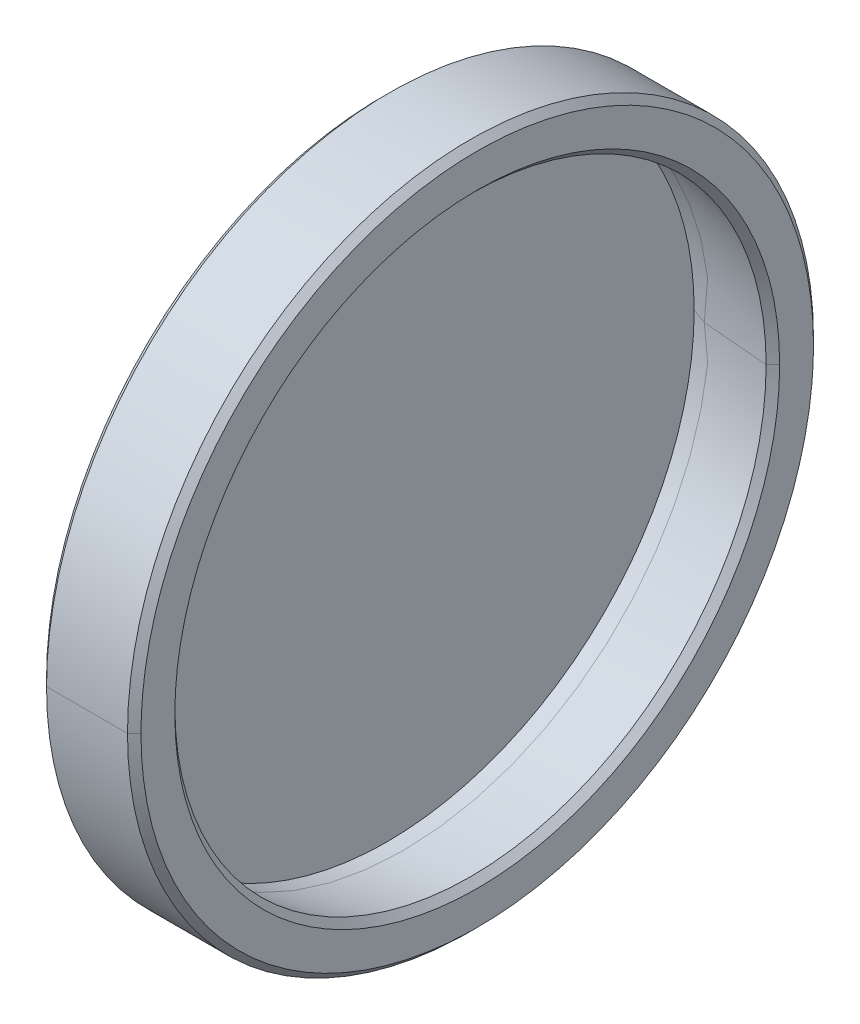
ISO-10303-21;
HEADER;
FILE_DESCRIPTION(('STEP AP214'),'2;1');
FILE_NAME('part.step','',(''),(''),'','','');
FILE_SCHEMA(('AUTOMOTIVE_DESIGN { 1 0 10303 214 1 1 1 1 }'));
ENDSEC;
DATA;
#1=APPLICATION_CONTEXT('core data for automotive mechanical design processes');
#2=APPLICATION_PROTOCOL_DEFINITION('international standard','automotive_design',2000,#1);
#3=PRODUCT_CONTEXT('',#1,'mechanical');
#4=PRODUCT('Part','Part','',(#3));
#5=PRODUCT_RELATED_PRODUCT_CATEGORY('part','',(#4));
#6=PRODUCT_DEFINITION_FORMATION('','',#4);
#7=PRODUCT_DEFINITION_CONTEXT('part definition',#1,'design');
#8=PRODUCT_DEFINITION('design','',#6,#7);
#9=PRODUCT_DEFINITION_SHAPE('','',#8);
#10=(LENGTH_UNIT() NAMED_UNIT(*) SI_UNIT(.MILLI.,.METRE.));
#11=(NAMED_UNIT(*) PLANE_ANGLE_UNIT() SI_UNIT($,.RADIAN.));
#12=(NAMED_UNIT(*) SI_UNIT($,.STERADIAN.) SOLID_ANGLE_UNIT());
#13=UNCERTAINTY_MEASURE_WITH_UNIT(LENGTH_MEASURE(1.E-05),#10,'distance_accuracy_value','');
#14=(GEOMETRIC_REPRESENTATION_CONTEXT(3) GLOBAL_UNCERTAINTY_ASSIGNED_CONTEXT((#13)) GLOBAL_UNIT_ASSIGNED_CONTEXT((#10,
#11,#12)) REPRESENTATION_CONTEXT('',''));
#15=CARTESIAN_POINT('',(0.,0.,0.));
#16=DIRECTION('',(0.,0.,1.));
#17=DIRECTION('',(1.,0.,0.));
#18=AXIS2_PLACEMENT_3D('',#15,#16,#17);
#19=CARTESIAN_POINT('',(0.9,0.,0.));
#20=DIRECTION('',(-1.,0.,0.));
#21=DIRECTION('',(0.,0.,1.));
#22=AXIS2_PLACEMENT_3D('',#19,#20,#21);
#23=CYLINDRICAL_SURFACE('',#22,13.645);
#24=CARTESIAN_POINT('',(0.9,0.,0.));
#25=DIRECTION('',(1.,0.,0.));
#26=DIRECTION('',(0.,0.,-1.));
#27=AXIS2_PLACEMENT_3D('',#24,#25,#26);
#28=CIRCLE('',#27,13.645);
#29=CARTESIAN_POINT('',(0.9,0.,-13.395));
#30=VERTEX_POINT('',#29);
#31=CARTESIAN_POINT('',(0.9,0.,13.395));
#32=VERTEX_POINT('',#31);
#33=EDGE_CURVE('E34',#30,#32,#28,.T.);
#34=ORIENTED_EDGE('',*,*,#33,.T.);
#35=CARTESIAN_POINT('',(0.2,0.,13.645));
#36=DIRECTION('',(1.,0.,0.));
#37=VECTOR('',#36,1.);
#38=LINE('',#35,#37);
#39=CARTESIAN_POINT('',(0.2,0.,13.645));
#40=VERTEX_POINT('',#39);
#41=EDGE_CURVE('E91',#40,#32,#38,.T.);
#42=ORIENTED_EDGE('',*,*,#41,.F.);
#43=CARTESIAN_POINT('',(0.2,0.,-13.645));
#44=CARTESIAN_POINT('',(0.2,1.34363747488083,-13.645));
#45=CARTESIAN_POINT('',(0.2,2.66200744391007,-13.3828151511021));
#46=CARTESIAN_POINT('',(0.2,3.97957081874608,-13.1207907099665));
#47=CARTESIAN_POINT('',(0.2,5.22171543462165,-12.6063362211165));
#48=CARTESIAN_POINT('',(0.2,6.46284376605702,-12.0923026430731));
#49=CARTESIAN_POINT('',(0.2,7.58075582955247,-11.3454028598682));
#50=CARTESIAN_POINT('',(0.2,8.6977532518318,-10.5991141670597));
#51=CARTESIAN_POINT('',(0.2,9.64847202929044,-9.64847202929044));
#52=CARTESIAN_POINT('',(0.2,10.5984129579128,-8.69860767765319));
#53=CARTESIAN_POINT('',(0.2,11.3454028598682,-7.58075582955247));
#54=CARTESIAN_POINT('',(0.2,12.0917815976864,-6.46381857341421));
#55=CARTESIAN_POINT('',(0.2,12.6063362211165,-5.22171543462165));
#56=CARTESIAN_POINT('',(0.2,13.1204698518036,-3.98062854635668));
#57=CARTESIAN_POINT('',(0.2,13.3828151511021,-2.66200744391007));
#58=CARTESIAN_POINT('',(0.2,13.6449458075597,-1.34446519662178));
#59=CARTESIAN_POINT('',(0.2,13.645,0.));
#60=CARTESIAN_POINT('',(0.2,13.6450541481017,1.34336519663393));
#61=CARTESIAN_POINT('',(0.2,13.3828151511021,2.66200744391007));
#62=CARTESIAN_POINT('',(0.2,13.1207907099659,3.97957081874861));
#63=CARTESIAN_POINT('',(0.2,12.6063362211165,5.22171543462165));
#64=CARTESIAN_POINT('',(0.2,12.092302643072,6.46284376605874));
#65=CARTESIAN_POINT('',(0.2,11.3454028598682,7.58075582955247));
#66=CARTESIAN_POINT('',(0.2,10.5991141670512,8.69775325184458));
#67=CARTESIAN_POINT('',(0.2,9.64847202929044,9.64847202929044));
#68=CARTESIAN_POINT('',(0.2,8.69860767764255,10.5984129579192));
#69=CARTESIAN_POINT('',(0.2,7.58075582955247,11.3454028598682));
#70=CARTESIAN_POINT('',(0.2,6.463818573417,12.0917815976852));
#71=CARTESIAN_POINT('',(0.2,5.22171543462165,12.6063362211165));
#72=CARTESIAN_POINT('',(0.2,3.98062854635668,13.1204698518036));
#73=CARTESIAN_POINT('',(0.2,2.66200744391007,13.3828151511021));
#74=CARTESIAN_POINT('',(0.2,1.34419281020761,13.645));
#75=CARTESIAN_POINT('',(0.2,0.,13.645));
#76=B_SPLINE_CURVE_WITH_KNOTS('',2,(#43,#44,#45,#46,#47,#48,#49,#50,#51,#52,#53,#54,#55,#56,#57,
#58,#59,#60,#61,#62,#63,#64,#65,#66,#67,#68,#69,#70,#71,#72,#73,#74,#75),.UNSPECIFIED.,.F.,.F.,
(3,2,2,2,2,2,2,2,2,2,2,2,2,2,2,2,3),(0.,0.0625,0.125,0.1875,0.25,0.3125,0.375,0.4375,0.5,0.5625,
0.625,0.6875,0.75,0.8125,0.875,0.9375,1.),.UNSPECIFIED.);
#77=CARTESIAN_POINT('',(0.2,0.,-13.645));
#78=VERTEX_POINT('',#77);
#79=EDGE_CURVE('E101',#78,#40,#76,.T.);
#80=ORIENTED_EDGE('',*,*,#79,.F.);
#81=CARTESIAN_POINT('',(0.9,0.,-13.645));
#82=DIRECTION('',(-1.,0.,0.));
#83=VECTOR('',#82,1.);
#84=LINE('',#81,#83);
#85=EDGE_CURVE('E88',#30,#78,#84,.T.);
#86=ORIENTED_EDGE('',*,*,#85,.F.);
#87=EDGE_LOOP('',(#34,#42,#80,#86));
#88=FACE_BOUND('',#87,.T.);
#89=ADVANCED_FACE('F15',(#88),#23,.F.);
#90=CARTESIAN_POINT('',(0.2,0.,0.));
#91=DIRECTION('',(1.,0.,0.));
#92=DIRECTION('',(0.,1.,0.));
#93=AXIS2_PLACEMENT_3D('',#90,#91,#92);
#94=PLANE('',#93);
#95=CARTESIAN_POINT('',(0.2,0.,13.645));
#96=CARTESIAN_POINT('',(0.2,-1.34363747488136,13.645));
#97=CARTESIAN_POINT('',(0.2,-2.66200744391007,13.3828151511021));
#98=CARTESIAN_POINT('',(0.2,-3.97957081873673,13.1207907099683));
#99=CARTESIAN_POINT('',(0.2,-5.22171543462165,12.6063362211165));
#100=CARTESIAN_POINT('',(0.2,-6.46284376604588,12.0923026430799));
#101=CARTESIAN_POINT('',(0.2,-7.58075582955247,11.3454028598682));
#102=CARTESIAN_POINT('',(0.2,-8.69775325183606,10.5991141670576));
#103=CARTESIAN_POINT('',(0.2,-9.64847202929044,9.64847202929044));
#104=CARTESIAN_POINT('',(0.2,-10.5984129579213,8.69860767764255));
#105=CARTESIAN_POINT('',(0.2,-11.3454028598682,7.58075582955247));
#106=CARTESIAN_POINT('',(0.2,-12.0917815976898,6.46381857340692));
#107=CARTESIAN_POINT('',(0.2,-12.6063362211165,5.22171543462166));
#108=CARTESIAN_POINT('',(0.2,-13.1204698518081,3.9806285463448));
#109=CARTESIAN_POINT('',(0.2,-13.3828151511021,2.66200744391007));
#110=CARTESIAN_POINT('',(0.2,-13.6449458075597,1.34446519661112));
#111=CARTESIAN_POINT('',(0.2,-13.645,0.));
#112=CARTESIAN_POINT('',(0.2,-13.6450541481017,-1.3433651966334));
#113=CARTESIAN_POINT('',(0.2,-13.3828151511021,-2.66200744391007));
#114=CARTESIAN_POINT('',(0.2,-13.1207907099661,-3.97957081874812));
#115=CARTESIAN_POINT('',(0.2,-12.6063362211165,-5.22171543462165));
#116=CARTESIAN_POINT('',(0.2,-12.0923026430708,-6.46284376606153));
#117=CARTESIAN_POINT('',(0.2,-11.3454028598682,-7.58075582955247));
#118=CARTESIAN_POINT('',(0.2,-10.5991141670533,-8.69775325184033));
#119=CARTESIAN_POINT('',(0.2,-9.64847202929044,-9.64847202929044));
#120=CARTESIAN_POINT('',(0.2,-8.69860767764467,-10.5984129579192));
#121=CARTESIAN_POINT('',(0.2,-7.58075582955247,-11.3454028598682));
#122=CARTESIAN_POINT('',(0.2,-6.46381857341141,-12.0917815976875));
#123=CARTESIAN_POINT('',(0.2,-5.22171543462166,-12.6063362211165));
#124=CARTESIAN_POINT('',(0.2,-3.98062854634684,-13.1204698518077));
#125=CARTESIAN_POINT('',(0.2,-2.66200744391007,-13.3828151511021));
#126=CARTESIAN_POINT('',(0.2,-1.34419281019695,-13.645));
#127=CARTESIAN_POINT('',(0.2,0.,-13.645));
#128=B_SPLINE_CURVE_WITH_KNOTS('',2,(#95,#96,#97,#98,#99,#100,#101,#102,#103,#104,#105,#106,
#107,#108,#109,#110,#111,#112,#113,#114,#115,#116,#117,#118,#119,#120,#121,#122,#123,#124,#125,
#126,#127),.UNSPECIFIED.,.F.,.F.,(3,2,2,2,2,2,2,2,2,2,2,2,2,2,2,2,3),(0.,0.0625,0.125,0.1875,
0.25,0.3125,0.375,0.4375,0.5,0.5625,0.625,0.6875,0.75,0.8125,0.875,0.9375,1.),.UNSPECIFIED.);
#129=EDGE_CURVE('E350',#40,#78,#128,.T.);
#130=ORIENTED_EDGE('',*,*,#129,.T.);
#131=ORIENTED_EDGE('',*,*,#79,.T.);
#132=EDGE_LOOP('',(#130,#131));
#133=FACE_BOUND('',#132,.T.);
#134=ADVANCED_FACE('F366',(#133),#94,.T.);
#135=CARTESIAN_POINT('',(0.9,0.,0.));
#136=DIRECTION('',(-1.,0.,0.));
#137=DIRECTION('',(0.,0.,1.));
#138=AXIS2_PLACEMENT_3D('',#135,#136,#137);
#139=CYLINDRICAL_SURFACE('',#138,13.645);
#140=ORIENTED_EDGE('',*,*,#85,.T.);
#141=ORIENTED_EDGE('',*,*,#129,.F.);
#142=ORIENTED_EDGE('',*,*,#41,.T.);
#143=CARTESIAN_POINT('',(0.9,0.,0.));
#144=DIRECTION('',(1.,0.,0.));
#145=DIRECTION('',(0.,0.,1.));
#146=AXIS2_PLACEMENT_3D('',#143,#144,#145);
#147=CIRCLE('',#146,13.645);
#148=EDGE_CURVE('E9',#32,#30,#147,.T.);
#149=ORIENTED_EDGE('',*,*,#148,.T.);
#150=EDGE_LOOP('',(#140,#141,#142,#149));
#151=FACE_BOUND('',#150,.T.);
#152=ADVANCED_FACE('F86',(#151),#139,.F.);
#153=CARTESIAN_POINT('',(0.,0.,0.));
#154=DIRECTION('',(1.,0.,0.));
#155=DIRECTION('',(0.,1.,0.));
#156=AXIS2_PLACEMENT_3D('',#153,#154,#155);
#157=PLANE('',#156);
#158=CARTESIAN_POINT('',(0.,0.,0.));
#159=DIRECTION('',(1.,0.,0.));
#160=DIRECTION('',(0.,0.,-1.));
#161=AXIS2_PLACEMENT_3D('',#158,#159,#160);
#162=CIRCLE('',#161,14.95);
#163=CARTESIAN_POINT('',(0.,0.,-14.95));
#164=VERTEX_POINT('',#163);
#165=CARTESIAN_POINT('',(0.,0.,14.95));
#166=VERTEX_POINT('',#165);
#167=EDGE_CURVE('E338',#164,#166,#162,.T.);
#168=ORIENTED_EDGE('',*,*,#167,.F.);
#169=CARTESIAN_POINT('',(0.,0.,0.));
#170=DIRECTION('',(1.,0.,0.));
#171=DIRECTION('',(0.,0.,1.));
#172=AXIS2_PLACEMENT_3D('',#169,#170,#171);
#173=CIRCLE('',#172,14.95);
#174=EDGE_CURVE('E344',#166,#164,#173,.T.);
#175=ORIENTED_EDGE('',*,*,#174,.F.);
#176=EDGE_LOOP('',(#168,#175));
#177=FACE_BOUND('',#176,.T.);
#178=ADVANCED_FACE('F385',(#177),#157,.F.);
#179=CARTESIAN_POINT('',(0.3,0.,0.));
#180=DIRECTION('',(1.,0.,0.));
#181=DIRECTION('',(0.,0.,-1.));
#182=AXIS2_PLACEMENT_3D('',#179,#180,#181);
#183=CONICAL_SURFACE('',#182,15.25,0.785398163397446);
#184=CARTESIAN_POINT('',(0.3,0.,-15.25));
#185=DIRECTION('',(-0.70710678118655,0.,0.707106781186545));
#186=VECTOR('',#185,1.);
#187=LINE('',#184,#186);
#188=CARTESIAN_POINT('',(0.3,0.,-15.25));
#189=VERTEX_POINT('',#188);
#190=EDGE_CURVE('E323',#189,#164,#187,.T.);
#191=ORIENTED_EDGE('',*,*,#190,.F.);
#192=CARTESIAN_POINT('',(0.3,0.,0.));
#193=DIRECTION('',(1.,0.,0.));
#194=DIRECTION('',(0.,0.,1.));
#195=AXIS2_PLACEMENT_3D('',#192,#193,#194);
#196=CIRCLE('',#195,15.25);
#197=CARTESIAN_POINT('',(0.3,0.,15.25));
#198=VERTEX_POINT('',#197);
#199=EDGE_CURVE('E316',#198,#189,#196,.T.);
#200=ORIENTED_EDGE('',*,*,#199,.F.);
#201=CARTESIAN_POINT('',(0.,0.,14.95));
#202=DIRECTION('',(0.70710678118655,0.,0.707106781186545));
#203=VECTOR('',#202,1.);
#204=LINE('',#201,#203);
#205=EDGE_CURVE('E330',#166,#198,#204,.T.);
#206=ORIENTED_EDGE('',*,*,#205,.F.);
#207=ORIENTED_EDGE('',*,*,#174,.T.);
#208=EDGE_LOOP('',(#191,#200,#206,#207));
#209=FACE_BOUND('',#208,.T.);
#210=ADVANCED_FACE('F635',(#209),#183,.T.);
#211=CARTESIAN_POINT('',(0.3,0.,0.));
#212=DIRECTION('',(1.,0.,0.));
#213=DIRECTION('',(0.,0.,-1.));
#214=AXIS2_PLACEMENT_3D('',#211,#212,#213);
#215=CONICAL_SURFACE('',#214,15.25,0.785398163397446);
#216=CARTESIAN_POINT('',(0.3,0.,0.));
#217=DIRECTION('',(1.,0.,0.));
#218=DIRECTION('',(0.,0.,-1.));
#219=AXIS2_PLACEMENT_3D('',#216,#217,#218);
#220=CIRCLE('',#219,15.25);
#221=EDGE_CURVE('E299',#189,#198,#220,.T.);
#222=ORIENTED_EDGE('',*,*,#221,.F.);
#223=ORIENTED_EDGE('',*,*,#190,.T.);
#224=ORIENTED_EDGE('',*,*,#167,.T.);
#225=ORIENTED_EDGE('',*,*,#205,.T.);
#226=EDGE_LOOP('',(#222,#223,#224,#225));
#227=FACE_BOUND('',#226,.T.);
#228=ADVANCED_FACE('F619',(#227),#215,.T.);
#229=CARTESIAN_POINT('',(4.2,0.,0.));
#230=DIRECTION('',(-1.,0.,0.));
#231=DIRECTION('',(0.,0.,1.));
#232=AXIS2_PLACEMENT_3D('',#229,#230,#231);
#233=CYLINDRICAL_SURFACE('',#232,15.25);
#234=CARTESIAN_POINT('',(0.3,0.,15.25));
#235=DIRECTION('',(1.,0.,0.));
#236=VECTOR('',#235,1.);
#237=LINE('',#234,#236);
#238=CARTESIAN_POINT('',(3.9,0.,15.25));
#239=VERTEX_POINT('',#238);
#240=EDGE_CURVE('E292',#198,#239,#237,.T.);
#241=ORIENTED_EDGE('',*,*,#240,.F.);
#242=ORIENTED_EDGE('',*,*,#199,.T.);
#243=CARTESIAN_POINT('',(3.89999999999999,0.,-15.25));
#244=DIRECTION('',(-1.,0.,0.));
#245=VECTOR('',#244,1.);
#246=LINE('',#243,#245);
#247=CARTESIAN_POINT('',(3.9,0.,-15.25));
#248=VERTEX_POINT('',#247);
#249=EDGE_CURVE('E308',#248,#189,#246,.T.);
#250=ORIENTED_EDGE('',*,*,#249,.F.);
#251=CARTESIAN_POINT('',(3.89999999999999,0.,0.));
#252=DIRECTION('',(1.,0.,0.));
#253=DIRECTION('',(0.,0.,1.));
#254=AXIS2_PLACEMENT_3D('',#251,#252,#253);
#255=CIRCLE('',#254,15.25);
#256=EDGE_CURVE('E285',#239,#248,#255,.T.);
#257=ORIENTED_EDGE('',*,*,#256,.F.);
#258=EDGE_LOOP('',(#241,#242,#250,#257));
#259=FACE_BOUND('',#258,.T.);
#260=ADVANCED_FACE('F595',(#259),#233,.T.);
#261=CARTESIAN_POINT('',(4.2,0.,0.));
#262=DIRECTION('',(-1.,0.,0.));
#263=DIRECTION('',(0.,0.,1.));
#264=AXIS2_PLACEMENT_3D('',#261,#262,#263);
#265=CYLINDRICAL_SURFACE('',#264,15.25);
#266=ORIENTED_EDGE('',*,*,#221,.T.);
#267=ORIENTED_EDGE('',*,*,#240,.T.);
#268=CARTESIAN_POINT('',(3.89999999999999,0.,0.));
#269=DIRECTION('',(1.,0.,0.));
#270=DIRECTION('',(0.,0.,-1.));
#271=AXIS2_PLACEMENT_3D('',#268,#269,#270);
#272=CIRCLE('',#271,15.25);
#273=EDGE_CURVE('E268',#248,#239,#272,.T.);
#274=ORIENTED_EDGE('',*,*,#273,.F.);
#275=ORIENTED_EDGE('',*,*,#249,.T.);
#276=EDGE_LOOP('',(#266,#267,#274,#275));
#277=FACE_BOUND('',#276,.T.);
#278=ADVANCED_FACE('F579',(#277),#265,.T.);
#279=CARTESIAN_POINT('',(4.2,0.,0.));
#280=DIRECTION('',(-1.,0.,0.));
#281=DIRECTION('',(0.,0.,1.));
#282=AXIS2_PLACEMENT_3D('',#279,#280,#281);
#283=CONICAL_SURFACE('',#282,14.95,0.785398163397446);
#284=CARTESIAN_POINT('',(3.89999999999999,0.,15.25));
#285=DIRECTION('',(0.707106781186549,0.,-0.707106781186545));
#286=VECTOR('',#285,1.);
#287=LINE('',#284,#286);
#288=CARTESIAN_POINT('',(4.2,0.,14.95));
#289=VERTEX_POINT('',#288);
#290=EDGE_CURVE('E262',#239,#289,#287,.T.);
#291=ORIENTED_EDGE('',*,*,#290,.F.);
#292=ORIENTED_EDGE('',*,*,#256,.T.);
#293=CARTESIAN_POINT('',(4.2,0.,-14.95));
#294=DIRECTION('',(-0.707106781186549,0.,-0.707106781186545));
#295=VECTOR('',#294,1.);
#296=LINE('',#293,#295);
#297=CARTESIAN_POINT('',(4.2,0.,-14.95));
#298=VERTEX_POINT('',#297);
#299=EDGE_CURVE('E277',#298,#248,#296,.T.);
#300=ORIENTED_EDGE('',*,*,#299,.F.);
#301=CARTESIAN_POINT('',(4.2,0.,14.95));
#302=CARTESIAN_POINT('',(4.2,-1.47216876116469,14.95));
#303=CARTESIAN_POINT('',(4.2,-2.91660031414112,14.6627399420283));
#304=CARTESIAN_POINT('',(4.2,-4.36022527837732,14.3756402936847));
#305=CARTESIAN_POINT('',(4.2,-5.72111731385809,13.8119990110437));
#306=CARTESIAN_POINT('',(4.2,-7.08099306636477,13.2487786427913));
#307=CARTESIAN_POINT('',(4.2,-8.30577498364304,12.430470703923));
#308=CARTESIAN_POINT('',(4.2,-9.52964226186681,11.6127738586617));
#309=CARTESIAN_POINT('',(4.2,-10.5712463787389,10.5712463787389));
#310=CARTESIAN_POINT('',(4.2,-11.6120726495368,9.53049668765955));
#311=CARTESIAN_POINT('',(4.2,-12.430470703923,8.30577498364305));
#312=CARTESIAN_POINT('',(4.2,-13.2482575974103,7.08196787370897));
#313=CARTESIAN_POINT('',(4.2,-13.8119990110437,5.7211173138581));
#314=CARTESIAN_POINT('',(4.2,-14.375319435523,4.36128300598411));
#315=CARTESIAN_POINT('',(4.2,-14.6627399420283,2.91660031414112));
#316=CARTESIAN_POINT('',(4.2,-14.9499458094936,1.4729964781868));
#317=CARTESIAN_POINT('',(4.2,-14.95,0.));
#318=CARTESIAN_POINT('',(4.2,-14.9500541500381,-1.47189647820035));
#319=CARTESIAN_POINT('',(4.2,-14.6627399420283,-2.91660031414112));
#320=CARTESIAN_POINT('',(4.2,-14.37564029368,-4.36022527838862));
#321=CARTESIAN_POINT('',(4.2,-13.8119990110437,-5.72111731385809));
#322=CARTESIAN_POINT('',(4.2,-13.2487786427888,-7.08099306637088));
#323=CARTESIAN_POINT('',(4.2,-12.430470703923,-8.30577498364304));
#324=CARTESIAN_POINT('',(4.2,-11.6127738586523,-9.52964226187848));
#325=CARTESIAN_POINT('',(4.2,-10.5712463787389,-10.5712463787389));
#326=CARTESIAN_POINT('',(4.2,-9.53049668764788,-11.6120726495461));
#327=CARTESIAN_POINT('',(4.2,-8.30577498364305,-12.430470703923));
#328=CARTESIAN_POINT('',(4.2,-7.08196787370286,-13.2482575974129));
#329=CARTESIAN_POINT('',(4.2,-5.7211173138581,-13.8119990110437));
#330=CARTESIAN_POINT('',(4.2,-4.36128300598411,-14.375319435523));
#331=CARTESIAN_POINT('',(4.2,-2.91660031414112,-14.6627399420283));
#332=CARTESIAN_POINT('',(4.2,-1.47272409648544,-14.95));
#333=CARTESIAN_POINT('',(4.2,0.,-14.95));
#334=B_SPLINE_CURVE_WITH_KNOTS('',2,(#301,#302,#303,#304,#305,#306,#307,#308,#309,#310,#311,
#312,#313,#314,#315,#316,#317,#318,#319,#320,#321,#322,#323,#324,#325,#326,#327,#328,#329,#330,
#331,#332,#333),.UNSPECIFIED.,.F.,.F.,(3,2,2,2,2,2,2,2,2,2,2,2,2,2,2,2,3),(0.,0.0625,0.125,
0.1875,0.25,0.3125,0.375,0.4375,0.5,0.5625,0.625,0.6875,0.75,0.8125,0.875,0.9375,1.),.UNSPECIFIED.);
#335=EDGE_CURVE('E252',#289,#298,#334,.T.);
#336=ORIENTED_EDGE('',*,*,#335,.F.);
#337=EDGE_LOOP('',(#291,#292,#300,#336));
#338=FACE_BOUND('',#337,.T.);
#339=ADVANCED_FACE('F555',(#338),#283,.T.);
#340=CARTESIAN_POINT('',(4.2,0.,0.));
#341=DIRECTION('',(-1.,0.,0.));
#342=DIRECTION('',(0.,0.,1.));
#343=AXIS2_PLACEMENT_3D('',#340,#341,#342);
#344=CONICAL_SURFACE('',#343,14.95,0.785398163397446);
#345=ORIENTED_EDGE('',*,*,#273,.T.);
#346=ORIENTED_EDGE('',*,*,#290,.T.);
#347=CARTESIAN_POINT('',(4.2,0.,-14.95));
#348=CARTESIAN_POINT('',(4.2,1.47216876116623,-14.95));
#349=CARTESIAN_POINT('',(4.2,2.91660031414112,-14.6627399420283));
#350=CARTESIAN_POINT('',(4.2,4.3602252783788,-14.3756402936841));
#351=CARTESIAN_POINT('',(4.2,5.72111731385809,-13.8119990110437));
#352=CARTESIAN_POINT('',(4.2,7.08099306636506,-13.2487786427912));
#353=CARTESIAN_POINT('',(4.2,8.30577498364305,-12.430470703923));
#354=CARTESIAN_POINT('',(4.2,9.52964226185299,-11.6127738586708));
#355=CARTESIAN_POINT('',(4.2,10.5712463787389,-10.5712463787389));
#356=CARTESIAN_POINT('',(4.2,11.6120726495272,-9.53049668767375));
#357=CARTESIAN_POINT('',(4.2,12.430470703923,-8.30577498364305));
#358=CARTESIAN_POINT('',(4.2,13.248257597411,-7.08196787370805));
#359=CARTESIAN_POINT('',(4.2,13.8119990110437,-5.72111731385809));
#360=CARTESIAN_POINT('',(4.2,14.3753194355184,-4.36128300599435));
#361=CARTESIAN_POINT('',(4.2,14.6627399420283,-2.91660031414112));
#362=CARTESIAN_POINT('',(4.2,14.9499458094936,-1.4729964781994));
#363=CARTESIAN_POINT('',(4.2,14.95,0.));
#364=CARTESIAN_POINT('',(4.2,14.9500541500381,1.47189647818956));
#365=CARTESIAN_POINT('',(4.2,14.6627399420283,2.91660031414112));
#366=CARTESIAN_POINT('',(4.2,14.375640293684,4.3602252783795));
#367=CARTESIAN_POINT('',(4.2,13.8119990110437,5.72111731385809));
#368=CARTESIAN_POINT('',(4.2,13.2487786427845,7.08099306638073));
#369=CARTESIAN_POINT('',(4.2,12.430470703923,8.30577498364304));
#370=CARTESIAN_POINT('',(4.2,11.61277385865,9.52964226187848));
#371=CARTESIAN_POINT('',(4.2,10.5712463787389,10.5712463787389));
#372=CARTESIAN_POINT('',(4.2,9.53049668766654,11.6120726495298));
#373=CARTESIAN_POINT('',(4.2,8.30577498364305,12.430470703923));
#374=CARTESIAN_POINT('',(4.2,7.08196787371812,13.2482575974066));
#375=CARTESIAN_POINT('',(4.2,5.72111731385809,13.8119990110437));
#376=CARTESIAN_POINT('',(4.2,4.36128300599489,14.3753194355185));
#377=CARTESIAN_POINT('',(4.2,2.91660031414112,14.6627399420283));
#378=CARTESIAN_POINT('',(4.2,1.47272409649711,14.95));
#379=CARTESIAN_POINT('',(4.2,0.,14.95));
#380=B_SPLINE_CURVE_WITH_KNOTS('',2,(#347,#348,#349,#350,#351,#352,#353,#354,#355,#356,#357,
#358,#359,#360,#361,#362,#363,#364,#365,#366,#367,#368,#369,#370,#371,#372,#373,#374,#375,#376,
#377,#378,#379),.UNSPECIFIED.,.F.,.F.,(3,2,2,2,2,2,2,2,2,2,2,2,2,2,2,2,3),(0.,0.0625,0.125,
0.1875,0.25,0.3125,0.375,0.4375,0.5,0.5625,0.625,0.6875,0.75,0.8125,0.875,0.9375,1.),.UNSPECIFIED.);
#381=EDGE_CURVE('E245',#298,#289,#380,.T.);
#382=ORIENTED_EDGE('',*,*,#381,.F.);
#383=ORIENTED_EDGE('',*,*,#299,.T.);
#384=EDGE_LOOP('',(#345,#346,#382,#383));
#385=FACE_BOUND('',#384,.T.);
#386=ADVANCED_FACE('F536',(#385),#344,.T.);
#387=CARTESIAN_POINT('',(4.2,0.,0.));
#388=DIRECTION('',(1.,0.,0.));
#389=DIRECTION('',(0.,1.,0.));
#390=AXIS2_PLACEMENT_3D('',#387,#388,#389);
#391=PLANE('',#390);
#392=CARTESIAN_POINT('',(4.2,0.,-13.445));
#393=CARTESIAN_POINT('',(4.2,-1.32393919337343,-13.445));
#394=CARTESIAN_POINT('',(4.2,-2.62298937950684,-13.1866580950214));
#395=CARTESIAN_POINT('',(4.2,-3.92123297051703,-12.9284765974874));
#396=CARTESIAN_POINT('',(4.2,-5.14517874814863,-12.4215603146142));
#397=CARTESIAN_POINT('',(4.2,-6.36810824110222,-11.9150649419323));
#398=CARTESIAN_POINT('',(4.2,-7.46964178294855,-11.1791089374077));
#399=CARTESIAN_POINT('',(4.2,-8.57026068323837,-10.4437640227137));
#400=CARTESIAN_POINT('',(4.2,-9.50705067305313,-9.50705067305313));
#401=CARTESIAN_POINT('',(4.2,-10.4430628135822,-8.57111510904126));
#402=CARTESIAN_POINT('',(4.2,-11.1791089374077,-7.46964178294855));
#403=CARTESIAN_POINT('',(4.2,-11.9145438965481,-6.36908304845106));
#404=CARTESIAN_POINT('',(4.2,-12.4215603146142,-5.14517874814863));
#405=CARTESIAN_POINT('',(4.2,-12.9281557393253,-3.92229069812793));
#406=CARTESIAN_POINT('',(4.2,-13.1866580950214,-2.62298937950684));
#407=CARTESIAN_POINT('',(4.2,-13.444945807229,-1.32476691591946));
#408=CARTESIAN_POINT('',(4.2,-13.445,0.));
#409=CARTESIAN_POINT('',(4.2,-13.4450541477728,1.32366691592174));
#410=CARTESIAN_POINT('',(4.2,-13.1866580950214,2.62298937950684));
#411=CARTESIAN_POINT('',(4.2,-12.9284765974904,3.92123297050638));
#412=CARTESIAN_POINT('',(4.2,-12.4215603146142,5.14517874814863));
#413=CARTESIAN_POINT('',(4.2,-11.9150649419393,6.36810824108869));
#414=CARTESIAN_POINT('',(4.2,-11.1791089374077,7.46964178294854));
#415=CARTESIAN_POINT('',(4.2,-10.4437640227157,8.57026068323843));
#416=CARTESIAN_POINT('',(4.2,-9.50705067305313,9.50705067305312));
#417=CARTESIAN_POINT('',(4.2,-8.57111510903504,10.4430628135863));
#418=CARTESIAN_POINT('',(4.2,-7.46964178294855,11.1791089374077));
#419=CARTESIAN_POINT('',(4.2,-6.3690830484498,11.914543896549));
#420=CARTESIAN_POINT('',(4.2,-5.14517874814863,12.4215603146142));
#421=CARTESIAN_POINT('',(4.2,-3.92229069813293,12.9281557393229));
#422=CARTESIAN_POINT('',(4.2,-2.62298937950685,13.1866580950214));
#423=CARTESIAN_POINT('',(4.2,-1.32449452870378,13.445));
#424=CARTESIAN_POINT('',(4.2,0.,13.445));
#425=B_SPLINE_CURVE_WITH_KNOTS('',2,(#392,#393,#394,#395,#396,#397,#398,#399,#400,#401,#402,
#403,#404,#405,#406,#407,#408,#409,#410,#411,#412,#413,#414,#415,#416,#417,#418,#419,#420,#421,
#422,#423,#424),.UNSPECIFIED.,.F.,.F.,(3,2,2,2,2,2,2,2,2,2,2,2,2,2,2,2,3),(0.,0.0625,0.125,
0.1875,0.25,0.3125,0.375,0.4375,0.5,0.5625,0.625,0.6875,0.75,0.8125,0.875,0.9375,1.),.UNSPECIFIED.);
#426=CARTESIAN_POINT('',(4.2,0.,-13.445));
#427=VERTEX_POINT('',#426);
#428=CARTESIAN_POINT('',(4.2,0.,13.445));
#429=VERTEX_POINT('',#428);
#430=EDGE_CURVE('E231',#427,#429,#425,.T.);
#431=ORIENTED_EDGE('',*,*,#430,.T.);
#432=CARTESIAN_POINT('',(4.2,0.,13.445));
#433=CARTESIAN_POINT('',(4.2,1.32393919336594,13.445));
#434=CARTESIAN_POINT('',(4.2,2.62298937950684,13.1866580950214));
#435=CARTESIAN_POINT('',(4.2,3.92123297049444,12.9284765974934));
#436=CARTESIAN_POINT('',(4.2,5.14517874814863,12.4215603146142));
#437=CARTESIAN_POINT('',(4.2,6.36810824106708,11.9150649419502));
#438=CARTESIAN_POINT('',(4.2,7.46964178294854,11.1791089374077));
#439=CARTESIAN_POINT('',(4.2,8.57026068322164,10.4437640227304));
#440=CARTESIAN_POINT('',(4.2,9.50705067305312,9.50705067305313));
#441=CARTESIAN_POINT('',(4.2,10.4430628135884,8.57111510903504));
#442=CARTESIAN_POINT('',(4.2,11.1791089374077,7.46964178294855));
#443=CARTESIAN_POINT('',(4.2,11.9145438965579,6.36908304843335));
#444=CARTESIAN_POINT('',(4.2,12.4215603146142,5.14517874814864));
#445=CARTESIAN_POINT('',(4.2,12.9281557393288,3.92229069811353));
#446=CARTESIAN_POINT('',(4.2,13.1866580950214,2.62298937950685));
#447=CARTESIAN_POINT('',(4.2,13.444945807229,1.32476691591611));
#448=CARTESIAN_POINT('',(4.2,13.445,0.));
#449=CARTESIAN_POINT('',(4.2,13.4450541477728,-1.32366691591836));
#450=CARTESIAN_POINT('',(4.2,13.1866580950214,-2.62298937950684));
#451=CARTESIAN_POINT('',(4.2,12.9284765974912,-3.92123297050566));
#452=CARTESIAN_POINT('',(4.2,12.4215603146142,-5.14517874814863));
#453=CARTESIAN_POINT('',(4.2,11.9150649419413,-6.3681082410825));
#454=CARTESIAN_POINT('',(4.2,11.1791089374077,-7.46964178294854));
#455=CARTESIAN_POINT('',(4.2,10.443764022722,-8.57026068323214));
#456=CARTESIAN_POINT('',(4.2,9.50705067305313,-9.50705067305312));
#457=CARTESIAN_POINT('',(4.2,8.57111510903083,-10.4430628135905));
#458=CARTESIAN_POINT('',(4.2,7.46964178294855,-11.1791089374077));
#459=CARTESIAN_POINT('',(4.2,6.36908304843608,-11.9145438965567));
#460=CARTESIAN_POINT('',(4.2,5.14517874814864,-12.4215603146142));
#461=CARTESIAN_POINT('',(4.2,3.92229069812324,-12.9281557393248));
#462=CARTESIAN_POINT('',(4.2,2.62298937950685,-13.1866580950214));
#463=CARTESIAN_POINT('',(4.2,1.32449452870377,-13.445));
#464=CARTESIAN_POINT('',(4.2,0.,-13.445));
#465=B_SPLINE_CURVE_WITH_KNOTS('',2,(#432,#433,#434,#435,#436,#437,#438,#439,#440,#441,#442,
#443,#444,#445,#446,#447,#448,#449,#450,#451,#452,#453,#454,#455,#456,#457,#458,#459,#460,#461,
#462,#463,#464),.UNSPECIFIED.,.F.,.F.,(3,2,2,2,2,2,2,2,2,2,2,2,2,2,2,2,3),(0.,0.0625,0.125,
0.1875,0.25,0.3125,0.375,0.4375,0.5,0.5625,0.625,0.6875,0.75,0.8125,0.875,0.9375,1.),.UNSPECIFIED.);
#466=EDGE_CURVE('E240',#429,#427,#465,.T.);
#467=ORIENTED_EDGE('',*,*,#466,.T.);
#468=EDGE_LOOP('',(#431,#467));
#469=FACE_BOUND('',#468,.T.);
#470=ORIENTED_EDGE('',*,*,#335,.T.);
#471=ORIENTED_EDGE('',*,*,#381,.T.);
#472=EDGE_LOOP('',(#470,#471));
#473=FACE_BOUND('',#472,.T.);
#474=ADVANCED_FACE('F521',(#469,#473),#391,.T.);
#475=CARTESIAN_POINT('',(3.9,0.,0.));
#476=DIRECTION('',(1.,0.,0.));
#477=DIRECTION('',(0.,0.,-1.));
#478=AXIS2_PLACEMENT_3D('',#475,#476,#477);
#479=CONICAL_SURFACE('',#478,13.145,0.785398163397448);
#480=CARTESIAN_POINT('',(3.9,0.,0.));
#481=DIRECTION('',(-1.,0.,0.));
#482=DIRECTION('',(0.,0.,1.));
#483=AXIS2_PLACEMENT_3D('',#480,#481,#482);
#484=CIRCLE('',#483,13.145);
#485=CARTESIAN_POINT('',(3.9,0.,13.145));
#486=VERTEX_POINT('',#485);
#487=CARTESIAN_POINT('',(3.9,0.,-13.145));
#488=VERTEX_POINT('',#487);
#489=EDGE_CURVE('E80',#486,#488,#484,.T.);
#490=ORIENTED_EDGE('',*,*,#489,.T.);
#491=CARTESIAN_POINT('',(3.9,0.,-13.145));
#492=DIRECTION('',(0.707106781186547,0.,-0.707106781186547));
#493=VECTOR('',#492,1.);
#494=LINE('',#491,#493);
#495=EDGE_CURVE('E194',#488,#427,#494,.T.);
#496=ORIENTED_EDGE('',*,*,#495,.T.);
#497=ORIENTED_EDGE('',*,*,#466,.F.);
#498=CARTESIAN_POINT('',(4.19999999999999,0.,13.445));
#499=DIRECTION('',(-0.707106781186547,0.,-0.707106781186547));
#500=VECTOR('',#499,1.);
#501=LINE('',#498,#500);
#502=EDGE_CURVE('E177',#429,#486,#501,.T.);
#503=ORIENTED_EDGE('',*,*,#502,.T.);
#504=EDGE_LOOP('',(#490,#496,#497,#503));
#505=FACE_BOUND('',#504,.T.);
#506=ADVANCED_FACE('F213',(#505),#479,.F.);
#507=CARTESIAN_POINT('',(3.9,0.,0.));
#508=DIRECTION('',(1.,0.,0.));
#509=DIRECTION('',(0.,0.,-1.));
#510=AXIS2_PLACEMENT_3D('',#507,#508,#509);
#511=CONICAL_SURFACE('',#510,13.145,0.785398163397448);
#512=ORIENTED_EDGE('',*,*,#502,.F.);
#513=ORIENTED_EDGE('',*,*,#430,.F.);
#514=ORIENTED_EDGE('',*,*,#495,.F.);
#515=CARTESIAN_POINT('',(3.9,0.,0.));
#516=DIRECTION('',(-1.,0.,0.));
#517=DIRECTION('',(0.,0.,-1.));
#518=AXIS2_PLACEMENT_3D('',#515,#516,#517);
#519=CIRCLE('',#518,13.145);
#520=EDGE_CURVE('E120',#488,#486,#519,.T.);
#521=ORIENTED_EDGE('',*,*,#520,.T.);
#522=EDGE_LOOP('',(#512,#513,#514,#521));
#523=FACE_BOUND('',#522,.T.);
#524=ADVANCED_FACE('F191',(#523),#511,.F.);
#525=CARTESIAN_POINT('',(0.2,0.,0.));
#526=DIRECTION('',(1.,0.,0.));
#527=DIRECTION('',(0.,0.,-1.));
#528=AXIS2_PLACEMENT_3D('',#525,#526,#527);
#529=CYLINDRICAL_SURFACE('',#528,13.145);
#530=ORIENTED_EDGE('',*,*,#33,.F.);
#531=CARTESIAN_POINT('',(0.9,0.,-13.145));
#532=DIRECTION('',(1.,0.,0.));
#533=VECTOR('',#532,1.);
#534=LINE('',#531,#533);
#535=EDGE_CURVE('E109',#30,#488,#534,.T.);
#536=ORIENTED_EDGE('',*,*,#535,.T.);
#537=ORIENTED_EDGE('',*,*,#489,.F.);
#538=CARTESIAN_POINT('',(3.9,0.,13.145));
#539=DIRECTION('',(-1.,0.,0.));
#540=VECTOR('',#539,1.);
#541=LINE('',#538,#540);
#542=EDGE_CURVE('E27',#486,#32,#541,.T.);
#543=ORIENTED_EDGE('',*,*,#542,.T.);
#544=EDGE_LOOP('',(#530,#536,#537,#543));
#545=FACE_BOUND('',#544,.T.);
#546=ADVANCED_FACE('F108',(#545),#529,.F.);
#547=CARTESIAN_POINT('',(0.2,0.,0.));
#548=DIRECTION('',(1.,0.,0.));
#549=DIRECTION('',(0.,0.,-1.));
#550=AXIS2_PLACEMENT_3D('',#547,#548,#549);
#551=CYLINDRICAL_SURFACE('',#550,13.145);
#552=ORIENTED_EDGE('',*,*,#542,.F.);
#553=ORIENTED_EDGE('',*,*,#520,.F.);
#554=ORIENTED_EDGE('',*,*,#535,.F.);
#555=ORIENTED_EDGE('',*,*,#148,.F.);
#556=EDGE_LOOP('',(#552,#553,#554,#555));
#557=FACE_BOUND('',#556,.T.);
#558=ADVANCED_FACE('F118',(#557),#551,.F.);
#559=CLOSED_SHELL('',(#89,#134,#152,#178,#210,#228,#260,#278,#339,#386,#474,#506,#524,#546,#558));
#560=MANIFOLD_SOLID_BREP('B1',#559);
#561=ADVANCED_BREP_SHAPE_REPRESENTATION('',(#18,#560),#14);
#562=SHAPE_DEFINITION_REPRESENTATION(#9,#561);
ENDSEC;
END-ISO-10303-21;
